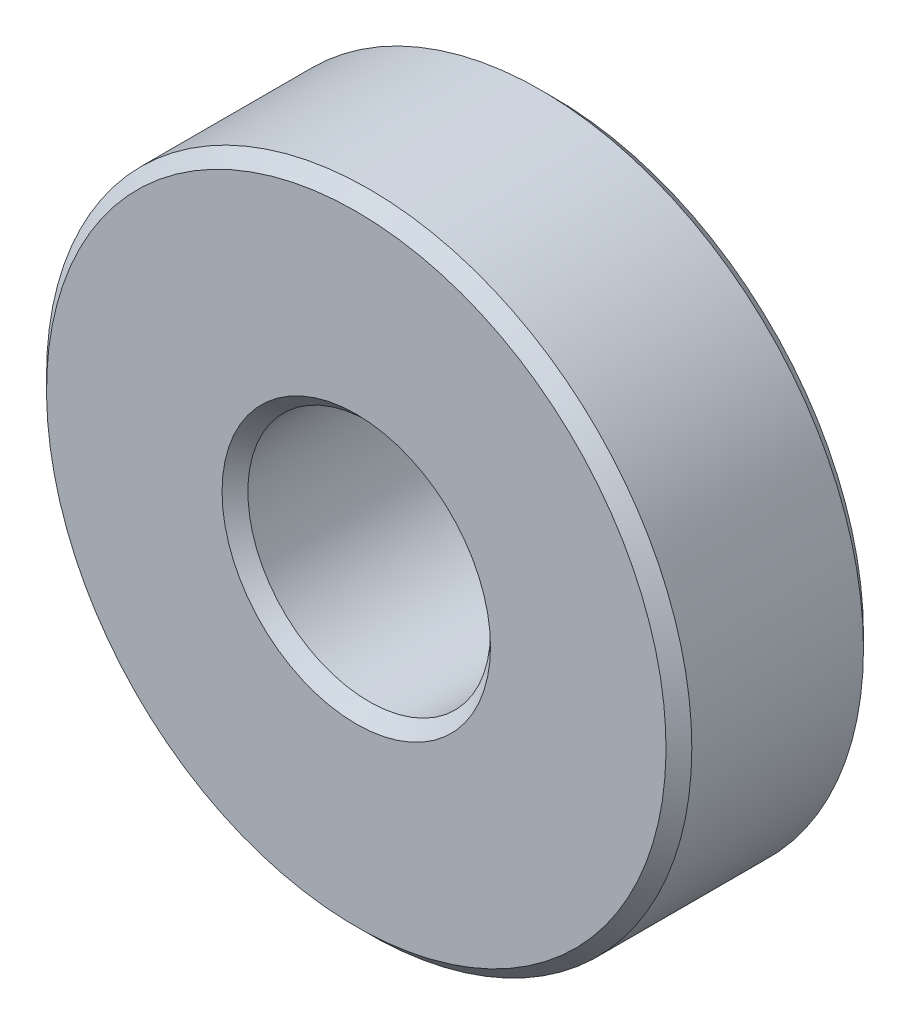
ISO-10303-21;
HEADER;
FILE_DESCRIPTION(('STEP AP214'),'2;1');
FILE_NAME('part.step','',(''),(''),'','','');
FILE_SCHEMA(('AUTOMOTIVE_DESIGN { 1 0 10303 214 1 1 1 1 }'));
ENDSEC;
DATA;
#1=APPLICATION_CONTEXT('core data for automotive mechanical design processes');
#2=APPLICATION_PROTOCOL_DEFINITION('international standard','automotive_design',2000,#1);
#3=PRODUCT_CONTEXT('',#1,'mechanical');
#4=PRODUCT('Part','Part','',(#3));
#5=PRODUCT_RELATED_PRODUCT_CATEGORY('part','',(#4));
#6=PRODUCT_DEFINITION_FORMATION('','',#4);
#7=PRODUCT_DEFINITION_CONTEXT('part definition',#1,'design');
#8=PRODUCT_DEFINITION('design','',#6,#7);
#9=PRODUCT_DEFINITION_SHAPE('','',#8);
#10=(LENGTH_UNIT() NAMED_UNIT(*) SI_UNIT(.MILLI.,.METRE.));
#11=(NAMED_UNIT(*) PLANE_ANGLE_UNIT() SI_UNIT($,.RADIAN.));
#12=(NAMED_UNIT(*) SI_UNIT($,.STERADIAN.) SOLID_ANGLE_UNIT());
#13=UNCERTAINTY_MEASURE_WITH_UNIT(LENGTH_MEASURE(1.E-05),#10,'distance_accuracy_value','');
#14=(GEOMETRIC_REPRESENTATION_CONTEXT(3) GLOBAL_UNCERTAINTY_ASSIGNED_CONTEXT((#13)) GLOBAL_UNIT_ASSIGNED_CONTEXT((#10,
#11,#12)) REPRESENTATION_CONTEXT('',''));
#15=CARTESIAN_POINT('',(0.,0.,0.));
#16=DIRECTION('',(0.,0.,1.));
#17=DIRECTION('',(1.,0.,0.));
#18=AXIS2_PLACEMENT_3D('',#15,#16,#17);
#19=CARTESIAN_POINT('',(0.,0.,0.));
#20=DIRECTION('',(0.,0.,-1.));
#21=DIRECTION('',(-1.,0.,0.));
#22=AXIS2_PLACEMENT_3D('',#19,#20,#21);
#23=PLANE('',#22);
#24=CARTESIAN_POINT('',(0.,0.,-5.6843418860808E-11));
#25=DIRECTION('',(0.,0.,-1.));
#26=DIRECTION('',(-1.,0.,0.));
#27=AXIS2_PLACEMENT_3D('',#24,#25,#26);
#28=CIRCLE('',#27,2.64159999994718);
#29=CARTESIAN_POINT('',(-2.64159999994718,0.,-5.6843418860808E-11));
#30=VERTEX_POINT('',#29);
#31=EDGE_CURVE('E32',#30,#30,#28,.F.);
#32=ORIENTED_EDGE('',*,*,#31,.T.);
#33=EDGE_LOOP('',(#32));
#34=FACE_BOUND('',#33,.T.);
#35=CARTESIAN_POINT('',(0.,0.,-5.6843418860808E-11));
#36=DIRECTION('',(0.,0.,1.));
#37=DIRECTION('',(1.,0.,0.));
#38=AXIS2_PLACEMENT_3D('',#35,#36,#37);
#39=CIRCLE('',#38,6.09599999989996);
#40=CARTESIAN_POINT('',(6.09599999989996,0.,-5.6843418860808E-11));
#41=VERTEX_POINT('',#40);
#42=EDGE_CURVE('E18',#41,#41,#39,.T.);
#43=ORIENTED_EDGE('',*,*,#42,.F.);
#44=EDGE_LOOP('',(#43));
#45=FACE_BOUND('',#44,.T.);
#46=ADVANCED_FACE('F15',(#34,#45),#23,.T.);
#47=CARTESIAN_POINT('',(0.,0.,0.253999999927146));
#48=DIRECTION('',(0.,0.,1.));
#49=DIRECTION('',(1.,0.,0.));
#50=AXIS2_PLACEMENT_3D('',#47,#48,#49);
#51=CONICAL_SURFACE('',#50,6.34999999988394,0.785398163397448);
#52=CARTESIAN_POINT('',(0.,0.,0.254));
#53=DIRECTION('',(0.,0.,1.));
#54=DIRECTION('',(1.,0.,0.));
#55=AXIS2_PLACEMENT_3D('',#52,#53,#54);
#56=CIRCLE('',#55,6.34999999999999);
#57=CARTESIAN_POINT('',(6.34999999999999,0.,0.254));
#58=VERTEX_POINT('',#57);
#59=EDGE_CURVE('E30',#58,#58,#56,.T.);
#60=ORIENTED_EDGE('',*,*,#59,.F.);
#61=EDGE_LOOP('',(#60));
#62=FACE_BOUND('',#61,.T.);
#63=ORIENTED_EDGE('',*,*,#42,.T.);
#64=EDGE_LOOP('',(#63));
#65=FACE_BOUND('',#64,.T.);
#66=ADVANCED_FACE('F41',(#62,#65),#51,.T.);
#67=CARTESIAN_POINT('',(0.,0.,-5.6843418860808E-11));
#68=DIRECTION('',(0.,0.,-1.));
#69=DIRECTION('',(-1.,0.,0.));
#70=AXIS2_PLACEMENT_3D('',#67,#68,#69);
#71=CONICAL_SURFACE('',#70,2.64159999994718,0.785398163285552);
#72=CARTESIAN_POINT('',(0.,0.,0.254000000040833));
#73=DIRECTION('',(0.,0.,1.));
#74=DIRECTION('',(1.,0.,0.));
#75=AXIS2_PLACEMENT_3D('',#72,#73,#74);
#76=CIRCLE('',#75,2.3876);
#77=CARTESIAN_POINT('',(2.3876,0.,0.254000000040833));
#78=VERTEX_POINT('',#77);
#79=EDGE_CURVE('E37',#78,#78,#76,.T.);
#80=ORIENTED_EDGE('',*,*,#79,.T.);
#81=EDGE_LOOP('',(#80));
#82=FACE_BOUND('',#81,.T.);
#83=ORIENTED_EDGE('',*,*,#31,.F.);
#84=EDGE_LOOP('',(#83));
#85=FACE_BOUND('',#84,.T.);
#86=ADVANCED_FACE('F48',(#82,#85),#71,.F.);
#87=CARTESIAN_POINT('',(0.,0.,3.8862));
#88=DIRECTION('',(0.,0.,1.));
#89=DIRECTION('',(1.,0.,0.));
#90=AXIS2_PLACEMENT_3D('',#87,#88,#89);
#91=CYLINDRICAL_SURFACE('',#90,6.34999999999999);
#92=CARTESIAN_POINT('',(0.,0.,3.63220000002684));
#93=DIRECTION('',(0.,0.,-1.));
#94=DIRECTION('',(-1.,0.,0.));
#95=AXIS2_PLACEMENT_3D('',#92,#93,#94);
#96=CIRCLE('',#95,6.3499999999408);
#97=CARTESIAN_POINT('',(-6.34999999994079,0.,3.63220000002684));
#98=VERTEX_POINT('',#97);
#99=EDGE_CURVE('E81',#98,#98,#96,.F.);
#100=ORIENTED_EDGE('',*,*,#99,.F.);
#101=EDGE_LOOP('',(#100));
#102=FACE_BOUND('',#101,.T.);
#103=ORIENTED_EDGE('',*,*,#59,.T.);
#104=EDGE_LOOP('',(#103));
#105=FACE_BOUND('',#104,.T.);
#106=ADVANCED_FACE('F69',(#102,#105),#91,.T.);
#107=CARTESIAN_POINT('',(0.,0.,3.8862));
#108=DIRECTION('',(0.,0.,1.));
#109=DIRECTION('',(1.,0.,0.));
#110=AXIS2_PLACEMENT_3D('',#107,#108,#109);
#111=CYLINDRICAL_SURFACE('',#110,2.3876);
#112=ORIENTED_EDGE('',*,*,#79,.F.);
#113=EDGE_LOOP('',(#112));
#114=FACE_BOUND('',#113,.T.);
#115=CARTESIAN_POINT('',(0.,0.,3.63219999997));
#116=DIRECTION('',(0.,0.,1.));
#117=DIRECTION('',(1.,0.,0.));
#118=AXIS2_PLACEMENT_3D('',#115,#116,#117);
#119=CIRCLE('',#118,2.38759999996318);
#120=CARTESIAN_POINT('',(2.38759999996319,0.,3.63219999997));
#121=VERTEX_POINT('',#120);
#122=EDGE_CURVE('E27',#121,#121,#119,.T.);
#123=ORIENTED_EDGE('',*,*,#122,.T.);
#124=EDGE_LOOP('',(#123));
#125=FACE_BOUND('',#124,.T.);
#126=ADVANCED_FACE('F65',(#114,#125),#111,.F.);
#127=CARTESIAN_POINT('',(0.,0.,3.63220000008369));
#128=DIRECTION('',(0.,0.,-1.));
#129=DIRECTION('',(0.,1.,0.));
#130=AXIS2_PLACEMENT_3D('',#127,#128,#129);
#131=CONICAL_SURFACE('',#130,6.34999999988395,0.785398163397448);
#132=ORIENTED_EDGE('',*,*,#99,.T.);
#133=EDGE_LOOP('',(#132));
#134=FACE_BOUND('',#133,.T.);
#135=CARTESIAN_POINT('',(0.,0.,3.88620000001083));
#136=DIRECTION('',(0.,0.,-1.));
#137=DIRECTION('',(0.,1.,0.));
#138=AXIS2_PLACEMENT_3D('',#135,#136,#137);
#139=CIRCLE('',#138,6.09599999995681);
#140=CARTESIAN_POINT('',(0.,6.09599999995681,3.88620000001083));
#141=VERTEX_POINT('',#140);
#142=EDGE_CURVE('E22',#141,#141,#139,.T.);
#143=ORIENTED_EDGE('',*,*,#142,.T.);
#144=EDGE_LOOP('',(#143));
#145=FACE_BOUND('',#144,.T.);
#146=ADVANCED_FACE('F58',(#134,#145),#131,.T.);
#147=CARTESIAN_POINT('',(0.,0.,3.88620000006767));
#148=DIRECTION('',(0.,0.,1.));
#149=DIRECTION('',(1.,0.,0.));
#150=AXIS2_PLACEMENT_3D('',#147,#148,#149);
#151=CONICAL_SURFACE('',#150,2.64160000000401,0.785398163285552);
#152=ORIENTED_EDGE('',*,*,#122,.F.);
#153=EDGE_LOOP('',(#152));
#154=FACE_BOUND('',#153,.T.);
#155=CARTESIAN_POINT('',(0.,0.,3.88620000006767));
#156=DIRECTION('',(0.,0.,1.));
#157=DIRECTION('',(1.,0.,0.));
#158=AXIS2_PLACEMENT_3D('',#155,#156,#157);
#159=CIRCLE('',#158,2.64160000000401);
#160=CARTESIAN_POINT('',(2.64160000000402,0.,3.88620000006767));
#161=VERTEX_POINT('',#160);
#162=EDGE_CURVE('E10',#161,#161,#159,.T.);
#163=ORIENTED_EDGE('',*,*,#162,.T.);
#164=EDGE_LOOP('',(#163));
#165=FACE_BOUND('',#164,.T.);
#166=ADVANCED_FACE('F52',(#154,#165),#151,.F.);
#167=CARTESIAN_POINT('',(0.,0.,3.8862));
#168=DIRECTION('',(0.,0.,-1.));
#169=DIRECTION('',(-1.,0.,0.));
#170=AXIS2_PLACEMENT_3D('',#167,#168,#169);
#171=PLANE('',#170);
#172=ORIENTED_EDGE('',*,*,#162,.F.);
#173=EDGE_LOOP('',(#172));
#174=FACE_BOUND('',#173,.T.);
#175=ORIENTED_EDGE('',*,*,#142,.F.);
#176=EDGE_LOOP('',(#175));
#177=FACE_BOUND('',#176,.T.);
#178=ADVANCED_FACE('F50',(#174,#177),#171,.F.);
#179=CLOSED_SHELL('',(#46,#66,#86,#106,#126,#146,#166,#178));
#180=MANIFOLD_SOLID_BREP('B1',#179);
#181=ADVANCED_BREP_SHAPE_REPRESENTATION('',(#18,#180),#14);
#182=SHAPE_DEFINITION_REPRESENTATION(#9,#181);
ENDSEC;
END-ISO-10303-21;
